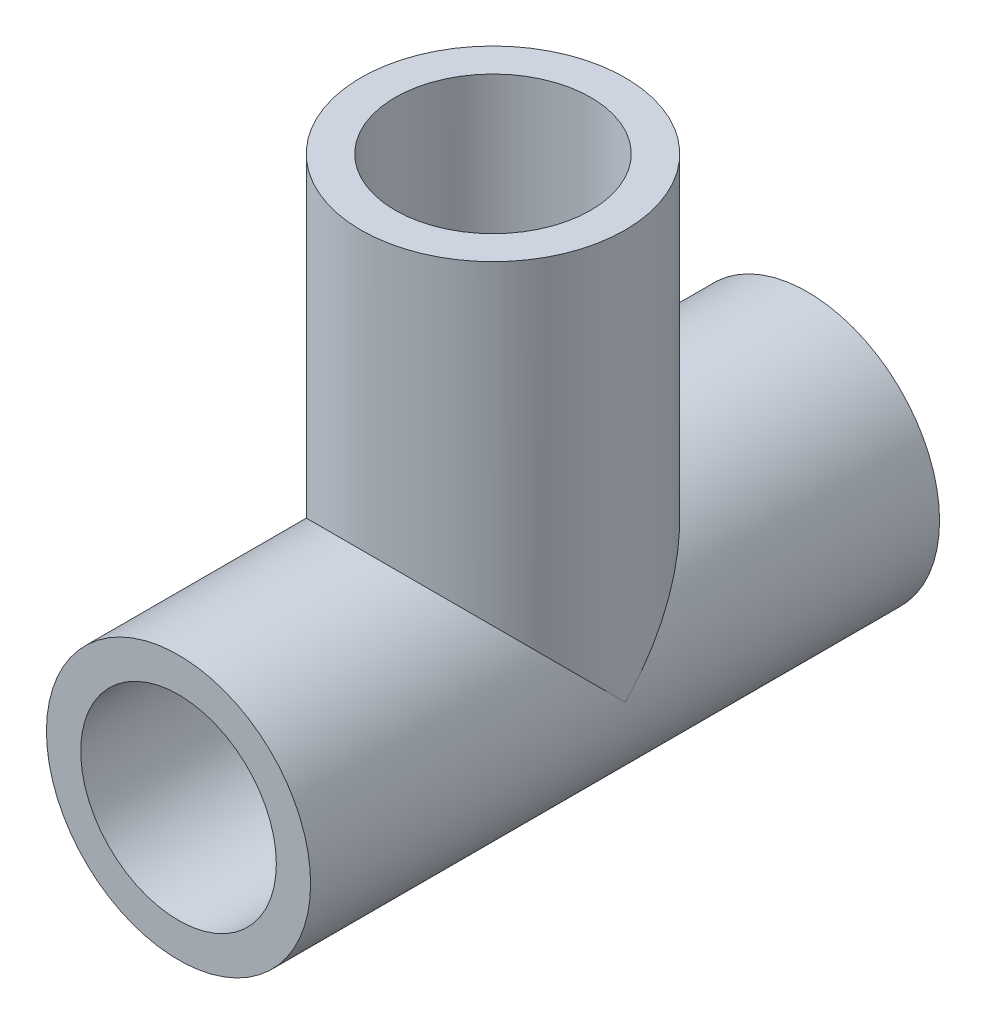
ISO-10303-21;
HEADER;
FILE_DESCRIPTION(('STEP AP214'),'2;1');
FILE_NAME('part.step','',(''),(''),'','','');
FILE_SCHEMA(('AUTOMOTIVE_DESIGN { 1 0 10303 214 1 1 1 1 }'));
ENDSEC;
DATA;
#1=APPLICATION_CONTEXT('core data for automotive mechanical design processes');
#2=APPLICATION_PROTOCOL_DEFINITION('international standard','automotive_design',2000,#1);
#3=PRODUCT_CONTEXT('',#1,'mechanical');
#4=PRODUCT('Part','Part','',(#3));
#5=PRODUCT_RELATED_PRODUCT_CATEGORY('part','',(#4));
#6=PRODUCT_DEFINITION_FORMATION('','',#4);
#7=PRODUCT_DEFINITION_CONTEXT('part definition',#1,'design');
#8=PRODUCT_DEFINITION('design','',#6,#7);
#9=PRODUCT_DEFINITION_SHAPE('','',#8);
#10=(LENGTH_UNIT() NAMED_UNIT(*) SI_UNIT(.MILLI.,.METRE.));
#11=(NAMED_UNIT(*) PLANE_ANGLE_UNIT() SI_UNIT($,.RADIAN.));
#12=(NAMED_UNIT(*) SI_UNIT($,.STERADIAN.) SOLID_ANGLE_UNIT());
#13=UNCERTAINTY_MEASURE_WITH_UNIT(LENGTH_MEASURE(1.E-05),#10,'distance_accuracy_value','');
#14=(GEOMETRIC_REPRESENTATION_CONTEXT(3) GLOBAL_UNCERTAINTY_ASSIGNED_CONTEXT((#13)) GLOBAL_UNIT_ASSIGNED_CONTEXT((#10,
#11,#12)) REPRESENTATION_CONTEXT('',''));
#15=CARTESIAN_POINT('',(0.,0.,0.));
#16=DIRECTION('',(0.,0.,1.));
#17=DIRECTION('',(1.,0.,0.));
#18=AXIS2_PLACEMENT_3D('',#15,#16,#17);
#19=CARTESIAN_POINT('',(0.,0.,50.8));
#20=DIRECTION('',(0.,0.,-1.));
#21=DIRECTION('',(-1.,0.,0.));
#22=AXIS2_PLACEMENT_3D('',#19,#20,#21);
#23=CYLINDRICAL_SURFACE('',#22,10.668);
#24=CARTESIAN_POINT('',(0.,0.,0.));
#25=DIRECTION('',(0.,0.,1.));
#26=DIRECTION('',(1.,0.,0.));
#27=AXIS2_PLACEMENT_3D('',#24,#25,#26);
#28=CIRCLE('',#27,10.668);
#29=CARTESIAN_POINT('',(10.668,0.,0.));
#30=VERTEX_POINT('',#29);
#31=EDGE_CURVE('E35',#30,#30,#28,.T.);
#32=ORIENTED_EDGE('',*,*,#31,.T.);
#33=EDGE_LOOP('',(#32));
#34=FACE_BOUND('',#33,.T.);
#35=CARTESIAN_POINT('',(0.,0.,50.8));
#36=DIRECTION('',(0.,0.,1.));
#37=DIRECTION('',(1.,0.,0.));
#38=AXIS2_PLACEMENT_3D('',#35,#36,#37);
#39=CIRCLE('',#38,10.668);
#40=CARTESIAN_POINT('',(10.668,0.,50.8));
#41=VERTEX_POINT('',#40);
#42=EDGE_CURVE('E11',#41,#41,#39,.T.);
#43=ORIENTED_EDGE('',*,*,#42,.F.);
#44=EDGE_LOOP('',(#43));
#45=FACE_BOUND('',#44,.T.);
#46=CARTESIAN_POINT('',(0.,0.,25.4));
#47=DIRECTION('',(0.,-0.707106781186547,-0.707106781186547));
#48=DIRECTION('',(0.,0.707106781186547,-0.707106781186547));
#49=AXIS2_PLACEMENT_3D('',#46,#47,#48);
#50=ELLIPSE('',#49,15.0868302833962,10.668);
#51=CARTESIAN_POINT('',(10.668,0.,25.4));
#52=VERTEX_POINT('',#51);
#53=CARTESIAN_POINT('',(-10.668,0.,25.4));
#54=VERTEX_POINT('',#53);
#55=EDGE_CURVE('E72',#52,#54,#50,.F.);
#56=ORIENTED_EDGE('',*,*,#55,.F.);
#57=CARTESIAN_POINT('',(0.,0.,25.4));
#58=DIRECTION('',(0.,0.707106781186547,-0.707106781186547));
#59=DIRECTION('',(0.,-0.707106781186547,-0.707106781186547));
#60=AXIS2_PLACEMENT_3D('',#57,#58,#59);
#61=ELLIPSE('',#60,15.0868302833962,10.668);
#62=EDGE_CURVE('E52',#54,#52,#61,.T.);
#63=ORIENTED_EDGE('',*,*,#62,.F.);
#64=EDGE_LOOP('',(#56,#63));
#65=FACE_BOUND('',#64,.T.);
#66=ADVANCED_FACE('F32',(#34,#45,#65),#23,.T.);
#67=CARTESIAN_POINT('',(0.,0.,50.8));
#68=DIRECTION('',(0.,0.,1.));
#69=DIRECTION('',(1.,0.,0.));
#70=AXIS2_PLACEMENT_3D('',#67,#68,#69);
#71=PLANE('',#70);
#72=ORIENTED_EDGE('',*,*,#42,.T.);
#73=EDGE_LOOP('',(#72));
#74=FACE_BOUND('',#73,.T.);
#75=CARTESIAN_POINT('',(0.,0.,50.8));
#76=DIRECTION('',(0.,0.,1.));
#77=DIRECTION('',(1.,0.,0.));
#78=AXIS2_PLACEMENT_3D('',#75,#76,#77);
#79=CIRCLE('',#78,7.8994);
#80=CARTESIAN_POINT('',(7.8994,0.,50.8));
#81=VERTEX_POINT('',#80);
#82=EDGE_CURVE('E75',#81,#81,#79,.T.);
#83=ORIENTED_EDGE('',*,*,#82,.F.);
#84=EDGE_LOOP('',(#83));
#85=FACE_BOUND('',#84,.T.);
#86=ADVANCED_FACE('F94',(#74,#85),#71,.T.);
#87=CARTESIAN_POINT('',(0.,0.,0.));
#88=DIRECTION('',(0.,0.,1.));
#89=DIRECTION('',(1.,0.,0.));
#90=AXIS2_PLACEMENT_3D('',#87,#88,#89);
#91=PLANE('',#90);
#92=ORIENTED_EDGE('',*,*,#31,.F.);
#93=EDGE_LOOP('',(#92));
#94=FACE_BOUND('',#93,.T.);
#95=CARTESIAN_POINT('',(0.,0.,0.));
#96=DIRECTION('',(0.,0.,1.));
#97=DIRECTION('',(1.,0.,0.));
#98=AXIS2_PLACEMENT_3D('',#95,#96,#97);
#99=CIRCLE('',#98,7.8994);
#100=CARTESIAN_POINT('',(7.8994,0.,0.));
#101=VERTEX_POINT('',#100);
#102=EDGE_CURVE('E74',#101,#101,#99,.T.);
#103=ORIENTED_EDGE('',*,*,#102,.T.);
#104=EDGE_LOOP('',(#103));
#105=FACE_BOUND('',#104,.T.);
#106=ADVANCED_FACE('F81',(#94,#105),#91,.F.);
#107=CARTESIAN_POINT('',(0.,33.02,25.4));
#108=DIRECTION('',(0.,-1.,0.));
#109=DIRECTION('',(0.,0.,-1.));
#110=AXIS2_PLACEMENT_3D('',#107,#108,#109);
#111=CYLINDRICAL_SURFACE('',#110,10.668);
#112=CARTESIAN_POINT('',(0.,33.02,25.4));
#113=DIRECTION('',(0.,1.,0.));
#114=DIRECTION('',(0.,0.,1.));
#115=AXIS2_PLACEMENT_3D('',#112,#113,#114);
#116=CIRCLE('',#115,10.668);
#117=CARTESIAN_POINT('',(0.,33.02,36.068));
#118=VERTEX_POINT('',#117);
#119=EDGE_CURVE('E66',#118,#118,#116,.T.);
#120=ORIENTED_EDGE('',*,*,#119,.F.);
#121=EDGE_LOOP('',(#120));
#122=FACE_BOUND('',#121,.T.);
#123=ORIENTED_EDGE('',*,*,#62,.T.);
#124=ORIENTED_EDGE('',*,*,#55,.T.);
#125=EDGE_LOOP('',(#123,#124));
#126=FACE_BOUND('',#125,.T.);
#127=ADVANCED_FACE('F105',(#122,#126),#111,.T.);
#128=CARTESIAN_POINT('',(0.,33.02,25.4));
#129=DIRECTION('',(0.,-1.,0.));
#130=DIRECTION('',(0.,0.,-1.));
#131=AXIS2_PLACEMENT_3D('',#128,#129,#130);
#132=CYLINDRICAL_SURFACE('',#131,7.8994);
#133=CARTESIAN_POINT('',(0.,33.02,25.4));
#134=DIRECTION('',(0.,1.,0.));
#135=DIRECTION('',(0.,0.,1.));
#136=AXIS2_PLACEMENT_3D('',#133,#134,#135);
#137=CIRCLE('',#136,7.8994);
#138=CARTESIAN_POINT('',(0.,33.02,33.2994));
#139=VERTEX_POINT('',#138);
#140=EDGE_CURVE('E63',#139,#139,#137,.T.);
#141=ORIENTED_EDGE('',*,*,#140,.T.);
#142=EDGE_LOOP('',(#141));
#143=FACE_BOUND('',#142,.T.);
#144=CARTESIAN_POINT('',(0.,0.,25.4));
#145=DIRECTION('',(0.,0.707106781186547,0.707106781186547));
#146=DIRECTION('',(0.,0.707106781186547,-0.707106781186547));
#147=AXIS2_PLACEMENT_3D('',#144,#145,#146);
#148=ELLIPSE('',#147,11.17143861461,7.8994);
#149=CARTESIAN_POINT('',(7.8994,0.,25.4));
#150=VERTEX_POINT('',#149);
#151=CARTESIAN_POINT('',(-7.8994,0.,25.4));
#152=VERTEX_POINT('',#151);
#153=EDGE_CURVE('E57',#150,#152,#148,.T.);
#154=ORIENTED_EDGE('',*,*,#153,.F.);
#155=CARTESIAN_POINT('',(0.,0.,25.4));
#156=DIRECTION('',(0.,0.707106781186547,-0.707106781186547));
#157=DIRECTION('',(0.,0.707106781186547,0.707106781186547));
#158=AXIS2_PLACEMENT_3D('',#155,#156,#157);
#159=ELLIPSE('',#158,11.17143861461,7.8994);
#160=EDGE_CURVE('E45',#152,#150,#159,.T.);
#161=ORIENTED_EDGE('',*,*,#160,.F.);
#162=EDGE_LOOP('',(#154,#161));
#163=FACE_BOUND('',#162,.T.);
#164=ADVANCED_FACE('F58',(#143,#163),#132,.F.);
#165=CARTESIAN_POINT('',(0.,33.02,25.4));
#166=DIRECTION('',(0.,1.,0.));
#167=DIRECTION('',(0.,0.,1.));
#168=AXIS2_PLACEMENT_3D('',#165,#166,#167);
#169=PLANE('',#168);
#170=ORIENTED_EDGE('',*,*,#119,.T.);
#171=EDGE_LOOP('',(#170));
#172=FACE_BOUND('',#171,.T.);
#173=ORIENTED_EDGE('',*,*,#140,.F.);
#174=EDGE_LOOP('',(#173));
#175=FACE_BOUND('',#174,.T.);
#176=ADVANCED_FACE('F84',(#172,#175),#169,.T.);
#177=CARTESIAN_POINT('',(0.,0.,50.8));
#178=DIRECTION('',(0.,0.,-1.));
#179=DIRECTION('',(-1.,0.,0.));
#180=AXIS2_PLACEMENT_3D('',#177,#178,#179);
#181=CYLINDRICAL_SURFACE('',#180,7.8994);
#182=ORIENTED_EDGE('',*,*,#160,.T.);
#183=ORIENTED_EDGE('',*,*,#153,.T.);
#184=EDGE_LOOP('',(#182,#183));
#185=FACE_BOUND('',#184,.T.);
#186=ORIENTED_EDGE('',*,*,#82,.T.);
#187=EDGE_LOOP('',(#186));
#188=FACE_BOUND('',#187,.T.);
#189=ORIENTED_EDGE('',*,*,#102,.F.);
#190=EDGE_LOOP('',(#189));
#191=FACE_BOUND('',#190,.T.);
#192=ADVANCED_FACE('F61',(#185,#188,#191),#181,.F.);
#193=CLOSED_SHELL('',(#66,#86,#106,#127,#164,#176,#192));
#194=MANIFOLD_SOLID_BREP('B2',#193);
#195=ADVANCED_BREP_SHAPE_REPRESENTATION('',(#18,#194),#14);
#196=SHAPE_DEFINITION_REPRESENTATION(#9,#195);
ENDSEC;
END-ISO-10303-21;
